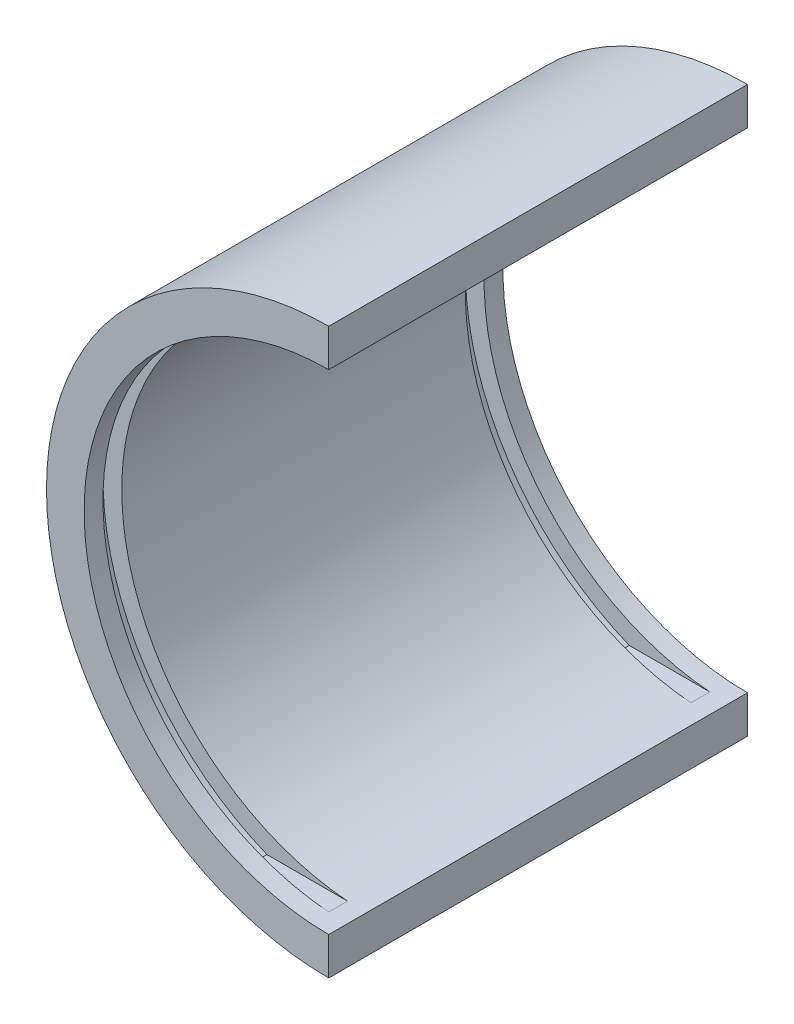
ISO-10303-21;
HEADER;
FILE_DESCRIPTION(('STEP AP214'),'2;1');
FILE_NAME('part.step','',(''),(''),'','','');
FILE_SCHEMA(('AUTOMOTIVE_DESIGN { 1 0 10303 214 1 1 1 1 }'));
ENDSEC;
DATA;
#1=APPLICATION_CONTEXT('core data for automotive mechanical design processes');
#2=APPLICATION_PROTOCOL_DEFINITION('international standard','automotive_design',2000,#1);
#3=PRODUCT_CONTEXT('',#1,'mechanical');
#4=PRODUCT('Part','Part','',(#3));
#5=PRODUCT_RELATED_PRODUCT_CATEGORY('part','',(#4));
#6=PRODUCT_DEFINITION_FORMATION('','',#4);
#7=PRODUCT_DEFINITION_CONTEXT('part definition',#1,'design');
#8=PRODUCT_DEFINITION('design','',#6,#7);
#9=PRODUCT_DEFINITION_SHAPE('','',#8);
#10=(LENGTH_UNIT() NAMED_UNIT(*) SI_UNIT(.MILLI.,.METRE.));
#11=(NAMED_UNIT(*) PLANE_ANGLE_UNIT() SI_UNIT($,.RADIAN.));
#12=(NAMED_UNIT(*) SI_UNIT($,.STERADIAN.) SOLID_ANGLE_UNIT());
#13=UNCERTAINTY_MEASURE_WITH_UNIT(LENGTH_MEASURE(1.E-05),#10,'distance_accuracy_value','');
#14=(GEOMETRIC_REPRESENTATION_CONTEXT(3) GLOBAL_UNCERTAINTY_ASSIGNED_CONTEXT((#13)) GLOBAL_UNIT_ASSIGNED_CONTEXT((#10,
#11,#12)) REPRESENTATION_CONTEXT('',''));
#15=CARTESIAN_POINT('',(0.,0.,0.));
#16=DIRECTION('',(0.,0.,1.));
#17=DIRECTION('',(1.,0.,0.));
#18=AXIS2_PLACEMENT_3D('',#15,#16,#17);
#19=CARTESIAN_POINT('',(0.,0.,222.57));
#20=DIRECTION('',(0.,0.,-1.));
#21=DIRECTION('',(-1.,0.,0.));
#22=AXIS2_PLACEMENT_3D('',#19,#20,#21);
#23=CYLINDRICAL_SURFACE('',#22,130.);
#24=CARTESIAN_POINT('',(0.,0.,202.57));
#25=DIRECTION('',(0.,0.,-1.));
#26=DIRECTION('',(1.,0.,0.));
#27=AXIS2_PLACEMENT_3D('',#24,#25,#26);
#28=CIRCLE('',#27,130.);
#29=CARTESIAN_POINT('',(-10.,-129.614813968157,202.57));
#30=VERTEX_POINT('',#29);
#31=CARTESIAN_POINT('',(-10.,129.614813968157,202.57));
#32=VERTEX_POINT('',#31);
#33=EDGE_CURVE('E183',#30,#32,#28,.T.);
#34=ORIENTED_EDGE('',*,*,#33,.F.);
#35=DIRECTION('',(0.,0.,1.));
#36=VECTOR('',#35,1.);
#37=CARTESIAN_POINT('',(-10.,-129.614813968157,202.57));
#38=LINE('',#37,#36);
#39=CARTESIAN_POINT('',(-10.,-129.614813968157,212.57));
#40=VERTEX_POINT('',#39);
#41=EDGE_CURVE('E213',#30,#40,#38,.T.);
#42=ORIENTED_EDGE('',*,*,#41,.T.);
#43=CARTESIAN_POINT('',(0.,0.,212.57));
#44=DIRECTION('',(0.,0.,-1.));
#45=DIRECTION('',(1.,0.,0.));
#46=AXIS2_PLACEMENT_3D('',#43,#44,#45);
#47=CIRCLE('',#46,130.);
#48=CARTESIAN_POINT('',(-10.,129.614813968157,212.57));
#49=VERTEX_POINT('',#48);
#50=EDGE_CURVE('E177',#40,#49,#47,.T.);
#51=ORIENTED_EDGE('',*,*,#50,.T.);
#52=DIRECTION('',(0.,0.,1.));
#53=VECTOR('',#52,1.);
#54=CARTESIAN_POINT('',(-10.,129.614813968157,202.57));
#55=LINE('',#54,#53);
#56=EDGE_CURVE('E200',#32,#49,#55,.T.);
#57=ORIENTED_EDGE('',*,*,#56,.F.);
#58=EDGE_LOOP('',(#34,#42,#51,#57));
#59=FACE_BOUND('',#58,.T.);
#60=CARTESIAN_POINT('',(0.,0.,0.));
#61=DIRECTION('',(0.,0.,-1.));
#62=DIRECTION('',(1.,0.,0.));
#63=AXIS2_PLACEMENT_3D('',#60,#61,#62);
#64=CIRCLE('',#63,130.);
#65=CARTESIAN_POINT('',(0.,-130.,0.));
#66=VERTEX_POINT('',#65);
#67=CARTESIAN_POINT('',(0.,130.,0.));
#68=VERTEX_POINT('',#67);
#69=EDGE_CURVE('E247',#66,#68,#64,.T.);
#70=ORIENTED_EDGE('',*,*,#69,.T.);
#71=DIRECTION('',(0.,0.,-1.));
#72=VECTOR('',#71,1.);
#73=CARTESIAN_POINT('',(0.,130.,222.57));
#74=LINE('',#73,#72);
#75=CARTESIAN_POINT('',(0.,130.,222.57));
#76=VERTEX_POINT('',#75);
#77=EDGE_CURVE('E255',#76,#68,#74,.T.);
#78=ORIENTED_EDGE('',*,*,#77,.F.);
#79=CARTESIAN_POINT('',(0.,0.,222.57));
#80=DIRECTION('',(0.,0.,-1.));
#81=DIRECTION('',(1.,0.,0.));
#82=AXIS2_PLACEMENT_3D('',#79,#80,#81);
#83=CIRCLE('',#82,130.);
#84=CARTESIAN_POINT('',(0.,-130.,222.57));
#85=VERTEX_POINT('',#84);
#86=EDGE_CURVE('E234',#85,#76,#83,.T.);
#87=ORIENTED_EDGE('',*,*,#86,.F.);
#88=DIRECTION('',(0.,0.,-1.));
#89=VECTOR('',#88,1.);
#90=CARTESIAN_POINT('',(0.,-130.,222.57));
#91=LINE('',#90,#89);
#92=EDGE_CURVE('E48',#85,#66,#91,.T.);
#93=ORIENTED_EDGE('',*,*,#92,.T.);
#94=EDGE_LOOP('',(#70,#78,#87,#93));
#95=FACE_BOUND('',#94,.T.);
#96=CARTESIAN_POINT('',(0.,0.,20.));
#97=DIRECTION('',(0.,0.,-1.));
#98=DIRECTION('',(-1.,0.,0.));
#99=AXIS2_PLACEMENT_3D('',#96,#97,#98);
#100=CIRCLE('',#99,130.);
#101=CARTESIAN_POINT('',(-9.99999999999997,129.614813968157,20.));
#102=VERTEX_POINT('',#101);
#103=CARTESIAN_POINT('',(-9.99999999999997,-129.614813968157,20.));
#104=VERTEX_POINT('',#103);
#105=EDGE_CURVE('E143',#102,#104,#100,.F.);
#106=ORIENTED_EDGE('',*,*,#105,.F.);
#107=DIRECTION('',(0.,0.,-1.));
#108=VECTOR('',#107,1.);
#109=CARTESIAN_POINT('',(-9.99999999999997,129.614813968157,20.));
#110=LINE('',#109,#108);
#111=CARTESIAN_POINT('',(-9.99999999999997,129.614813968157,10.));
#112=VERTEX_POINT('',#111);
#113=EDGE_CURVE('E138',#102,#112,#110,.T.);
#114=ORIENTED_EDGE('',*,*,#113,.T.);
#115=CARTESIAN_POINT('',(0.,0.,10.));
#116=DIRECTION('',(0.,0.,-1.));
#117=DIRECTION('',(-1.,0.,0.));
#118=AXIS2_PLACEMENT_3D('',#115,#116,#117);
#119=CIRCLE('',#118,130.);
#120=CARTESIAN_POINT('',(-9.99999999999997,-129.614813968157,10.));
#121=VERTEX_POINT('',#120);
#122=EDGE_CURVE('E159',#112,#121,#119,.F.);
#123=ORIENTED_EDGE('',*,*,#122,.T.);
#124=DIRECTION('',(0.,0.,-1.));
#125=VECTOR('',#124,1.);
#126=CARTESIAN_POINT('',(-9.99999999999997,-129.614813968157,20.));
#127=LINE('',#126,#125);
#128=EDGE_CURVE('E178',#104,#121,#127,.T.);
#129=ORIENTED_EDGE('',*,*,#128,.F.);
#130=EDGE_LOOP('',(#106,#114,#123,#129));
#131=FACE_BOUND('',#130,.T.);
#132=ADVANCED_FACE('F39',(#59,#95,#131),#23,.F.);
#133=CARTESIAN_POINT('',(0.,0.,222.57));
#134=DIRECTION('',(0.,0.,-1.));
#135=DIRECTION('',(-1.,0.,0.));
#136=AXIS2_PLACEMENT_3D('',#133,#134,#135);
#137=CYLINDRICAL_SURFACE('',#136,150.);
#138=CARTESIAN_POINT('',(0.,0.,0.));
#139=DIRECTION('',(0.,0.,1.));
#140=DIRECTION('',(1.,0.,0.));
#141=AXIS2_PLACEMENT_3D('',#138,#139,#140);
#142=CIRCLE('',#141,150.);
#143=CARTESIAN_POINT('',(0.,150.,0.));
#144=VERTEX_POINT('',#143);
#145=CARTESIAN_POINT('',(0.,-150.,0.));
#146=VERTEX_POINT('',#145);
#147=EDGE_CURVE('E217',#144,#146,#142,.T.);
#148=ORIENTED_EDGE('',*,*,#147,.T.);
#149=DIRECTION('',(0.,0.,-1.));
#150=VECTOR('',#149,1.);
#151=CARTESIAN_POINT('',(0.,-150.,222.57));
#152=LINE('',#151,#150);
#153=CARTESIAN_POINT('',(0.,-150.,222.57));
#154=VERTEX_POINT('',#153);
#155=EDGE_CURVE('E11',#154,#146,#152,.T.);
#156=ORIENTED_EDGE('',*,*,#155,.F.);
#157=CARTESIAN_POINT('',(0.,0.,222.57));
#158=DIRECTION('',(0.,0.,1.));
#159=DIRECTION('',(1.,0.,0.));
#160=AXIS2_PLACEMENT_3D('',#157,#158,#159);
#161=CIRCLE('',#160,150.);
#162=CARTESIAN_POINT('',(0.,150.,222.57));
#163=VERTEX_POINT('',#162);
#164=EDGE_CURVE('E226',#163,#154,#161,.T.);
#165=ORIENTED_EDGE('',*,*,#164,.F.);
#166=DIRECTION('',(0.,0.,-1.));
#167=VECTOR('',#166,1.);
#168=CARTESIAN_POINT('',(0.,150.,222.57));
#169=LINE('',#168,#167);
#170=EDGE_CURVE('E240',#163,#144,#169,.T.);
#171=ORIENTED_EDGE('',*,*,#170,.T.);
#172=EDGE_LOOP('',(#148,#156,#165,#171));
#173=FACE_BOUND('',#172,.T.);
#174=ADVANCED_FACE('F41',(#173),#137,.T.);
#175=CARTESIAN_POINT('',(0.,-130.,222.57));
#176=DIRECTION('',(-1.,0.,0.));
#177=DIRECTION('',(0.,-1.,0.));
#178=AXIS2_PLACEMENT_3D('',#175,#176,#177);
#179=PLANE('',#178);
#180=DIRECTION('',(0.,1.,0.));
#181=VECTOR('',#180,1.);
#182=CARTESIAN_POINT('',(0.,-130.,0.));
#183=LINE('',#182,#181);
#184=EDGE_CURVE('E244',#146,#66,#183,.T.);
#185=ORIENTED_EDGE('',*,*,#184,.T.);
#186=ORIENTED_EDGE('',*,*,#92,.F.);
#187=DIRECTION('',(0.,1.,0.));
#188=VECTOR('',#187,1.);
#189=CARTESIAN_POINT('',(0.,-130.,222.57));
#190=LINE('',#189,#188);
#191=EDGE_CURVE('E230',#154,#85,#190,.T.);
#192=ORIENTED_EDGE('',*,*,#191,.F.);
#193=ORIENTED_EDGE('',*,*,#155,.T.);
#194=EDGE_LOOP('',(#185,#186,#192,#193));
#195=FACE_BOUND('',#194,.T.);
#196=ADVANCED_FACE('F280',(#195),#179,.F.);
#197=CARTESIAN_POINT('',(0.,150.,222.57));
#198=DIRECTION('',(-1.,0.,0.));
#199=DIRECTION('',(0.,-1.,0.));
#200=AXIS2_PLACEMENT_3D('',#197,#198,#199);
#201=PLANE('',#200);
#202=DIRECTION('',(0.,1.,0.));
#203=VECTOR('',#202,1.);
#204=CARTESIAN_POINT('',(0.,150.,0.));
#205=LINE('',#204,#203);
#206=EDGE_CURVE('E231',#68,#144,#205,.T.);
#207=ORIENTED_EDGE('',*,*,#206,.T.);
#208=ORIENTED_EDGE('',*,*,#170,.F.);
#209=DIRECTION('',(0.,1.,0.));
#210=VECTOR('',#209,1.);
#211=CARTESIAN_POINT('',(0.,150.,222.57));
#212=LINE('',#211,#210);
#213=EDGE_CURVE('E237',#76,#163,#212,.T.);
#214=ORIENTED_EDGE('',*,*,#213,.F.);
#215=ORIENTED_EDGE('',*,*,#77,.T.);
#216=EDGE_LOOP('',(#207,#208,#214,#215));
#217=FACE_BOUND('',#216,.T.);
#218=ADVANCED_FACE('F273',(#217),#201,.F.);
#219=CARTESIAN_POINT('',(0.,0.,222.57));
#220=DIRECTION('',(0.,0.,1.));
#221=DIRECTION('',(1.,0.,0.));
#222=AXIS2_PLACEMENT_3D('',#219,#220,#221);
#223=PLANE('',#222);
#224=ORIENTED_EDGE('',*,*,#164,.T.);
#225=ORIENTED_EDGE('',*,*,#191,.T.);
#226=ORIENTED_EDGE('',*,*,#86,.T.);
#227=ORIENTED_EDGE('',*,*,#213,.T.);
#228=EDGE_LOOP('',(#224,#225,#226,#227));
#229=FACE_BOUND('',#228,.T.);
#230=ADVANCED_FACE('F279',(#229),#223,.T.);
#231=CARTESIAN_POINT('',(0.,0.,0.));
#232=DIRECTION('',(0.,0.,1.));
#233=DIRECTION('',(1.,0.,0.));
#234=AXIS2_PLACEMENT_3D('',#231,#232,#233);
#235=PLANE('',#234);
#236=ORIENTED_EDGE('',*,*,#147,.F.);
#237=ORIENTED_EDGE('',*,*,#206,.F.);
#238=ORIENTED_EDGE('',*,*,#69,.F.);
#239=ORIENTED_EDGE('',*,*,#184,.F.);
#240=EDGE_LOOP('',(#236,#237,#238,#239));
#241=FACE_BOUND('',#240,.T.);
#242=ADVANCED_FACE('F270',(#241),#235,.F.);
#243=CARTESIAN_POINT('',(-10.,-129.614813968157,202.57));
#244=DIRECTION('',(0.,-1.,0.));
#245=DIRECTION('',(0.,0.,-1.));
#246=AXIS2_PLACEMENT_3D('',#243,#244,#245);
#247=PLANE('',#246);
#248=DIRECTION('',(1.,0.,0.));
#249=VECTOR('',#248,1.);
#250=CARTESIAN_POINT('',(-10.,-129.614813968157,212.57));
#251=LINE('',#250,#249);
#252=CARTESIAN_POINT('',(-52.8421827649383,-129.614813968157,212.57));
#253=VERTEX_POINT('',#252);
#254=EDGE_CURVE('E188',#253,#40,#251,.T.);
#255=ORIENTED_EDGE('',*,*,#254,.T.);
#256=ORIENTED_EDGE('',*,*,#41,.F.);
#257=DIRECTION('',(1.,0.,0.));
#258=VECTOR('',#257,1.);
#259=CARTESIAN_POINT('',(-10.,-129.614813968157,202.57));
#260=LINE('',#259,#258);
#261=CARTESIAN_POINT('',(-52.8421827649383,-129.614813968157,202.57));
#262=VERTEX_POINT('',#261);
#263=EDGE_CURVE('E196',#262,#30,#260,.T.);
#264=ORIENTED_EDGE('',*,*,#263,.F.);
#265=DIRECTION('',(0.,0.,1.));
#266=VECTOR('',#265,1.);
#267=CARTESIAN_POINT('',(-52.8421827649383,-129.614813968157,202.57));
#268=LINE('',#267,#266);
#269=EDGE_CURVE('E218',#262,#253,#268,.T.);
#270=ORIENTED_EDGE('',*,*,#269,.T.);
#271=EDGE_LOOP('',(#255,#256,#264,#270));
#272=FACE_BOUND('',#271,.T.);
#273=ADVANCED_FACE('F296',(#272),#247,.F.);
#274=CARTESIAN_POINT('',(0.,0.,202.57));
#275=DIRECTION('',(0.,0.,1.));
#276=DIRECTION('',(1.,0.,0.));
#277=AXIS2_PLACEMENT_3D('',#274,#275,#276);
#278=CYLINDRICAL_SURFACE('',#277,139.972484007976);
#279=CARTESIAN_POINT('',(0.,0.,212.57));
#280=DIRECTION('',(0.,0.,1.));
#281=DIRECTION('',(1.,0.,0.));
#282=AXIS2_PLACEMENT_3D('',#279,#280,#281);
#283=CIRCLE('',#282,139.972484007976);
#284=CARTESIAN_POINT('',(-52.8421827649384,129.614813968157,212.57));
#285=VERTEX_POINT('',#284);
#286=EDGE_CURVE('E206',#285,#253,#283,.T.);
#287=ORIENTED_EDGE('',*,*,#286,.T.);
#288=ORIENTED_EDGE('',*,*,#269,.F.);
#289=CARTESIAN_POINT('',(0.,0.,202.57));
#290=DIRECTION('',(0.,0.,1.));
#291=DIRECTION('',(1.,0.,0.));
#292=AXIS2_PLACEMENT_3D('',#289,#290,#291);
#293=CIRCLE('',#292,139.972484007976);
#294=CARTESIAN_POINT('',(-52.8421827649384,129.614813968157,202.57));
#295=VERTEX_POINT('',#294);
#296=EDGE_CURVE('E192',#295,#262,#293,.T.);
#297=ORIENTED_EDGE('',*,*,#296,.F.);
#298=DIRECTION('',(0.,0.,1.));
#299=VECTOR('',#298,1.);
#300=CARTESIAN_POINT('',(-52.8421827649384,129.614813968157,202.57));
#301=LINE('',#300,#299);
#302=EDGE_CURVE('E221',#295,#285,#301,.T.);
#303=ORIENTED_EDGE('',*,*,#302,.T.);
#304=EDGE_LOOP('',(#287,#288,#297,#303));
#305=FACE_BOUND('',#304,.T.);
#306=ADVANCED_FACE('F303',(#305),#278,.F.);
#307=CARTESIAN_POINT('',(-10.,129.614813968157,202.57));
#308=DIRECTION('',(0.,1.,0.));
#309=DIRECTION('',(0.,0.,1.));
#310=AXIS2_PLACEMENT_3D('',#307,#308,#309);
#311=PLANE('',#310);
#312=DIRECTION('',(-1.,0.,0.));
#313=VECTOR('',#312,1.);
#314=CARTESIAN_POINT('',(-10.,129.614813968157,212.57));
#315=LINE('',#314,#313);
#316=EDGE_CURVE('E63',#49,#285,#315,.T.);
#317=ORIENTED_EDGE('',*,*,#316,.T.);
#318=ORIENTED_EDGE('',*,*,#302,.F.);
#319=DIRECTION('',(-1.,0.,0.));
#320=VECTOR('',#319,1.);
#321=CARTESIAN_POINT('',(-10.,129.614813968157,202.57));
#322=LINE('',#321,#320);
#323=EDGE_CURVE('E187',#32,#295,#322,.T.);
#324=ORIENTED_EDGE('',*,*,#323,.F.);
#325=ORIENTED_EDGE('',*,*,#56,.T.);
#326=EDGE_LOOP('',(#317,#318,#324,#325));
#327=FACE_BOUND('',#326,.T.);
#328=ADVANCED_FACE('F299',(#327),#311,.F.);
#329=CARTESIAN_POINT('',(0.,0.,202.57));
#330=DIRECTION('',(0.,0.,1.));
#331=DIRECTION('',(1.,0.,0.));
#332=AXIS2_PLACEMENT_3D('',#329,#330,#331);
#333=PLANE('',#332);
#334=ORIENTED_EDGE('',*,*,#33,.T.);
#335=ORIENTED_EDGE('',*,*,#323,.T.);
#336=ORIENTED_EDGE('',*,*,#296,.T.);
#337=ORIENTED_EDGE('',*,*,#263,.T.);
#338=EDGE_LOOP('',(#334,#335,#336,#337));
#339=FACE_BOUND('',#338,.T.);
#340=ADVANCED_FACE('F302',(#339),#333,.T.);
#341=CARTESIAN_POINT('',(0.,0.,212.57));
#342=DIRECTION('',(0.,0.,1.));
#343=DIRECTION('',(1.,0.,0.));
#344=AXIS2_PLACEMENT_3D('',#341,#342,#343);
#345=PLANE('',#344);
#346=ORIENTED_EDGE('',*,*,#50,.F.);
#347=ORIENTED_EDGE('',*,*,#254,.F.);
#348=ORIENTED_EDGE('',*,*,#286,.F.);
#349=ORIENTED_EDGE('',*,*,#316,.F.);
#350=EDGE_LOOP('',(#346,#347,#348,#349));
#351=FACE_BOUND('',#350,.T.);
#352=ADVANCED_FACE('F311',(#351),#345,.F.);
#353=CARTESIAN_POINT('',(0.,0.,20.));
#354=DIRECTION('',(0.,0.,-1.));
#355=DIRECTION('',(-1.,0.,0.));
#356=AXIS2_PLACEMENT_3D('',#353,#354,#355);
#357=CYLINDRICAL_SURFACE('',#356,139.972484007976);
#358=CARTESIAN_POINT('',(0.,0.,10.));
#359=DIRECTION('',(0.,0.,-1.));
#360=DIRECTION('',(-1.,0.,0.));
#361=AXIS2_PLACEMENT_3D('',#358,#359,#360);
#362=CIRCLE('',#361,139.972484007976);
#363=CARTESIAN_POINT('',(-52.8421827649383,129.614813968157,10.));
#364=VERTEX_POINT('',#363);
#365=CARTESIAN_POINT('',(-52.8421827649383,-129.614813968157,10.));
#366=VERTEX_POINT('',#365);
#367=EDGE_CURVE('E149',#364,#366,#362,.F.);
#368=ORIENTED_EDGE('',*,*,#367,.F.);
#369=DIRECTION('',(0.,0.,-1.));
#370=VECTOR('',#369,1.);
#371=CARTESIAN_POINT('',(-52.8421827649383,129.614813968157,20.));
#372=LINE('',#371,#370);
#373=CARTESIAN_POINT('',(-52.8421827649383,129.614813968157,20.));
#374=VERTEX_POINT('',#373);
#375=EDGE_CURVE('E135',#374,#364,#372,.T.);
#376=ORIENTED_EDGE('',*,*,#375,.F.);
#377=CARTESIAN_POINT('',(0.,0.,20.));
#378=DIRECTION('',(0.,0.,-1.));
#379=DIRECTION('',(-1.,0.,0.));
#380=AXIS2_PLACEMENT_3D('',#377,#378,#379);
#381=CIRCLE('',#380,139.972484007976);
#382=CARTESIAN_POINT('',(-52.8421827649383,-129.614813968157,20.));
#383=VERTEX_POINT('',#382);
#384=EDGE_CURVE('E144',#374,#383,#381,.F.);
#385=ORIENTED_EDGE('',*,*,#384,.T.);
#386=DIRECTION('',(0.,0.,-1.));
#387=VECTOR('',#386,1.);
#388=CARTESIAN_POINT('',(-52.8421827649383,-129.614813968157,20.));
#389=LINE('',#388,#387);
#390=EDGE_CURVE('E174',#383,#366,#389,.T.);
#391=ORIENTED_EDGE('',*,*,#390,.T.);
#392=EDGE_LOOP('',(#368,#376,#385,#391));
#393=FACE_BOUND('',#392,.T.);
#394=ADVANCED_FACE('F147',(#393),#357,.F.);
#395=CARTESIAN_POINT('',(0.,-129.614813968157,20.));
#396=DIRECTION('',(0.,-1.,0.));
#397=DIRECTION('',(0.,0.,-1.));
#398=AXIS2_PLACEMENT_3D('',#395,#396,#397);
#399=PLANE('',#398);
#400=DIRECTION('',(-1.,0.,0.));
#401=VECTOR('',#400,1.);
#402=CARTESIAN_POINT('',(0.,-129.614813968157,10.));
#403=LINE('',#402,#401);
#404=EDGE_CURVE('E55',#121,#366,#403,.T.);
#405=ORIENTED_EDGE('',*,*,#404,.T.);
#406=ORIENTED_EDGE('',*,*,#390,.F.);
#407=DIRECTION('',(-1.,0.,0.));
#408=VECTOR('',#407,1.);
#409=CARTESIAN_POINT('',(0.,-129.614813968157,20.));
#410=LINE('',#409,#408);
#411=EDGE_CURVE('E151',#104,#383,#410,.T.);
#412=ORIENTED_EDGE('',*,*,#411,.F.);
#413=ORIENTED_EDGE('',*,*,#128,.T.);
#414=EDGE_LOOP('',(#405,#406,#412,#413));
#415=FACE_BOUND('',#414,.T.);
#416=ADVANCED_FACE('F319',(#415),#399,.F.);
#417=CARTESIAN_POINT('',(0.,129.614813968157,20.));
#418=DIRECTION('',(0.,-1.,0.));
#419=DIRECTION('',(0.,0.,-1.));
#420=AXIS2_PLACEMENT_3D('',#417,#418,#419);
#421=PLANE('',#420);
#422=DIRECTION('',(-1.,0.,0.));
#423=VECTOR('',#422,1.);
#424=CARTESIAN_POINT('',(0.,129.614813968157,10.));
#425=LINE('',#424,#423);
#426=EDGE_CURVE('E168',#112,#364,#425,.T.);
#427=ORIENTED_EDGE('',*,*,#426,.F.);
#428=ORIENTED_EDGE('',*,*,#113,.F.);
#429=DIRECTION('',(-1.,0.,0.));
#430=VECTOR('',#429,1.);
#431=CARTESIAN_POINT('',(0.,129.614813968157,20.));
#432=LINE('',#431,#430);
#433=EDGE_CURVE('E132',#102,#374,#432,.T.);
#434=ORIENTED_EDGE('',*,*,#433,.T.);
#435=ORIENTED_EDGE('',*,*,#375,.T.);
#436=EDGE_LOOP('',(#427,#428,#434,#435));
#437=FACE_BOUND('',#436,.T.);
#438=ADVANCED_FACE('F134',(#437),#421,.T.);
#439=CARTESIAN_POINT('',(0.,0.,20.));
#440=DIRECTION('',(0.,0.,-1.));
#441=DIRECTION('',(-1.,0.,0.));
#442=AXIS2_PLACEMENT_3D('',#439,#440,#441);
#443=PLANE('',#442);
#444=ORIENTED_EDGE('',*,*,#384,.F.);
#445=ORIENTED_EDGE('',*,*,#433,.F.);
#446=ORIENTED_EDGE('',*,*,#105,.T.);
#447=ORIENTED_EDGE('',*,*,#411,.T.);
#448=EDGE_LOOP('',(#444,#445,#446,#447));
#449=FACE_BOUND('',#448,.T.);
#450=ADVANCED_FACE('F154',(#449),#443,.T.);
#451=CARTESIAN_POINT('',(0.,0.,10.));
#452=DIRECTION('',(0.,0.,-1.));
#453=DIRECTION('',(-1.,0.,0.));
#454=AXIS2_PLACEMENT_3D('',#451,#452,#453);
#455=PLANE('',#454);
#456=ORIENTED_EDGE('',*,*,#367,.T.);
#457=ORIENTED_EDGE('',*,*,#404,.F.);
#458=ORIENTED_EDGE('',*,*,#122,.F.);
#459=ORIENTED_EDGE('',*,*,#426,.T.);
#460=EDGE_LOOP('',(#456,#457,#458,#459));
#461=FACE_BOUND('',#460,.T.);
#462=ADVANCED_FACE('F325',(#461),#455,.F.);
#463=CLOSED_SHELL('',(#132,#174,#196,#218,#230,#242,#273,#306,#328,#340,#352,#394,#416,#438,
#450,#462));
#464=MANIFOLD_SOLID_BREP('B2',#463);
#465=ADVANCED_BREP_SHAPE_REPRESENTATION('',(#18,#464),#14);
#466=SHAPE_DEFINITION_REPRESENTATION(#9,#465);
ENDSEC;
END-ISO-10303-21;
